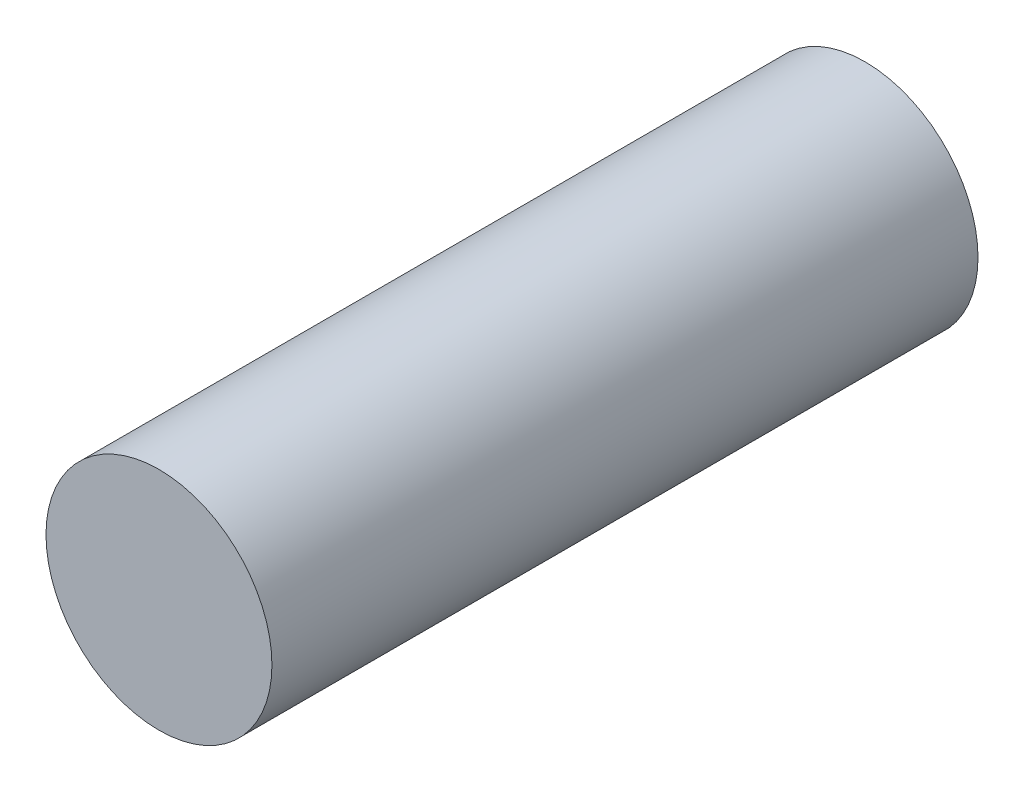
ISO-10303-21;
HEADER;
FILE_DESCRIPTION(('STEP AP214'),'2;1');
FILE_NAME('part.step','',(''),(''),'','','');
FILE_SCHEMA(('AUTOMOTIVE_DESIGN { 1 0 10303 214 1 1 1 1 }'));
ENDSEC;
DATA;
#1=APPLICATION_CONTEXT('core data for automotive mechanical design processes');
#2=APPLICATION_PROTOCOL_DEFINITION('international standard','automotive_design',2000,#1);
#3=PRODUCT_CONTEXT('',#1,'mechanical');
#4=PRODUCT('Part','Part','',(#3));
#5=PRODUCT_RELATED_PRODUCT_CATEGORY('part','',(#4));
#6=PRODUCT_DEFINITION_FORMATION('','',#4);
#7=PRODUCT_DEFINITION_CONTEXT('part definition',#1,'design');
#8=PRODUCT_DEFINITION('design','',#6,#7);
#9=PRODUCT_DEFINITION_SHAPE('','',#8);
#10=(LENGTH_UNIT() NAMED_UNIT(*) SI_UNIT(.MILLI.,.METRE.));
#11=(NAMED_UNIT(*) PLANE_ANGLE_UNIT() SI_UNIT($,.RADIAN.));
#12=(NAMED_UNIT(*) SI_UNIT($,.STERADIAN.) SOLID_ANGLE_UNIT());
#13=UNCERTAINTY_MEASURE_WITH_UNIT(LENGTH_MEASURE(1.E-05),#10,'distance_accuracy_value','');
#14=(GEOMETRIC_REPRESENTATION_CONTEXT(3) GLOBAL_UNCERTAINTY_ASSIGNED_CONTEXT((#13)) GLOBAL_UNIT_ASSIGNED_CONTEXT((#10,
#11,#12)) REPRESENTATION_CONTEXT('',''));
#15=CARTESIAN_POINT('',(0.,0.,0.));
#16=DIRECTION('',(0.,0.,1.));
#17=DIRECTION('',(1.,0.,0.));
#18=AXIS2_PLACEMENT_3D('',#15,#16,#17);
#19=CARTESIAN_POINT('',(0.3999992,0.,2.50000008));
#20=DIRECTION('',(0.,0.,-1.));
#21=DIRECTION('',(0.,-1.,0.));
#22=AXIS2_PLACEMENT_3D('',#19,#20,#21);
#23=PLANE('',#22);
#24=CARTESIAN_POINT('',(0.,0.,2.50000008));
#25=DIRECTION('',(0.,0.,1.));
#26=DIRECTION('',(1.,0.,0.));
#27=AXIS2_PLACEMENT_3D('',#24,#25,#26);
#28=CIRCLE('',#27,0.3999992);
#29=CARTESIAN_POINT('',(-0.3999992,0.,2.50000008));
#30=VERTEX_POINT('',#29);
#31=EDGE_CURVE('E11',#30,#30,#28,.T.);
#32=ORIENTED_EDGE('',*,*,#31,.T.);
#33=EDGE_LOOP('',(#32));
#34=FACE_BOUND('',#33,.T.);
#35=ADVANCED_FACE('F17',(#34),#23,.F.);
#36=CARTESIAN_POINT('',(0.3999992,0.,0.));
#37=DIRECTION('',(0.,0.,-1.));
#38=DIRECTION('',(0.,-1.,0.));
#39=AXIS2_PLACEMENT_3D('',#36,#37,#38);
#40=PLANE('',#39);
#41=CARTESIAN_POINT('',(0.,0.,0.));
#42=DIRECTION('',(0.,0.,1.));
#43=DIRECTION('',(1.,0.,0.));
#44=AXIS2_PLACEMENT_3D('',#41,#42,#43);
#45=CIRCLE('',#44,0.3999992);
#46=CARTESIAN_POINT('',(-0.3999992,0.,0.));
#47=VERTEX_POINT('',#46);
#48=EDGE_CURVE('E42',#47,#47,#45,.T.);
#49=ORIENTED_EDGE('',*,*,#48,.F.);
#50=EDGE_LOOP('',(#49));
#51=FACE_BOUND('',#50,.T.);
#52=ADVANCED_FACE('F64',(#51),#40,.T.);
#53=CARTESIAN_POINT('',(0.,0.,0.));
#54=DIRECTION('',(0.,0.,-1.));
#55=DIRECTION('',(1.,0.,0.));
#56=AXIS2_PLACEMENT_3D('',#53,#54,#55);
#57=CYLINDRICAL_SURFACE('',#56,0.3999992);
#58=ORIENTED_EDGE('',*,*,#48,.T.);
#59=DIRECTION('',(0.,0.,1.));
#60=VECTOR('',#59,1.);
#61=CARTESIAN_POINT('',(-0.3999992,0.,0.));
#62=LINE('',#61,#60);
#63=EDGE_CURVE('E20',#47,#30,#62,.T.);
#64=ORIENTED_EDGE('',*,*,#63,.T.);
#65=ORIENTED_EDGE('',*,*,#31,.F.);
#66=ORIENTED_EDGE('',*,*,#63,.F.);
#67=EDGE_LOOP('',(#58,#64,#65,#66));
#68=FACE_BOUND('',#67,.T.);
#69=ADVANCED_FACE('F40',(#68),#57,.T.);
#70=CLOSED_SHELL('',(#35,#52,#69));
#71=MANIFOLD_SOLID_BREP('B1',#70);
#72=ADVANCED_BREP_SHAPE_REPRESENTATION('',(#18,#71),#14);
#73=SHAPE_DEFINITION_REPRESENTATION(#9,#72);
ENDSEC;
END-ISO-10303-21;
